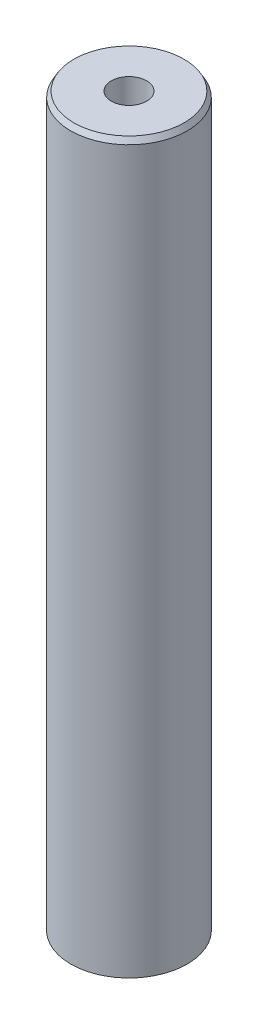
ISO-10303-21;
HEADER;
FILE_DESCRIPTION(('STEP AP214'),'2;1');
FILE_NAME('part.step','',(''),(''),'','','');
FILE_SCHEMA(('AUTOMOTIVE_DESIGN { 1 0 10303 214 1 1 1 1 }'));
ENDSEC;
DATA;
#1=APPLICATION_CONTEXT('core data for automotive mechanical design processes');
#2=APPLICATION_PROTOCOL_DEFINITION('international standard','automotive_design',2000,#1);
#3=PRODUCT_CONTEXT('',#1,'mechanical');
#4=PRODUCT('Part','Part','',(#3));
#5=PRODUCT_RELATED_PRODUCT_CATEGORY('part','',(#4));
#6=PRODUCT_DEFINITION_FORMATION('','',#4);
#7=PRODUCT_DEFINITION_CONTEXT('part definition',#1,'design');
#8=PRODUCT_DEFINITION('design','',#6,#7);
#9=PRODUCT_DEFINITION_SHAPE('','',#8);
#10=(LENGTH_UNIT() NAMED_UNIT(*) SI_UNIT(.MILLI.,.METRE.));
#11=(NAMED_UNIT(*) PLANE_ANGLE_UNIT() SI_UNIT($,.RADIAN.));
#12=(NAMED_UNIT(*) SI_UNIT($,.STERADIAN.) SOLID_ANGLE_UNIT());
#13=UNCERTAINTY_MEASURE_WITH_UNIT(LENGTH_MEASURE(1.E-05),#10,'distance_accuracy_value','');
#14=(GEOMETRIC_REPRESENTATION_CONTEXT(3) GLOBAL_UNCERTAINTY_ASSIGNED_CONTEXT((#13)) GLOBAL_UNIT_ASSIGNED_CONTEXT((#10,
#11,#12)) REPRESENTATION_CONTEXT('',''));
#15=CARTESIAN_POINT('',(0.,0.,0.));
#16=DIRECTION('',(0.,0.,1.));
#17=DIRECTION('',(1.,0.,0.));
#18=AXIS2_PLACEMENT_3D('',#15,#16,#17);
#19=CARTESIAN_POINT('',(0.,438.741525069619,0.));
#20=DIRECTION('',(0.,-1.,0.));
#21=DIRECTION('',(0.,0.,-1.));
#22=AXIS2_PLACEMENT_3D('',#19,#20,#21);
#23=CYLINDRICAL_SURFACE('',#22,35.);
#24=CARTESIAN_POINT('',(0.,435.481945707444,0.));
#25=DIRECTION('',(0.,1.,0.));
#26=DIRECTION('',(0.,0.,1.));
#27=AXIS2_PLACEMENT_3D('',#24,#25,#26);
#28=CIRCLE('',#27,35.);
#29=CARTESIAN_POINT('',(0.,435.481945707444,35.));
#30=VERTEX_POINT('',#29);
#31=EDGE_CURVE('E50',#30,#30,#28,.F.);
#32=ORIENTED_EDGE('',*,*,#31,.T.);
#33=EDGE_LOOP('',(#32));
#34=FACE_BOUND('',#33,.T.);
#35=CARTESIAN_POINT('',(0.,1.88191902219703,0.));
#36=DIRECTION('',(0.,1.,0.));
#37=DIRECTION('',(0.,0.,1.));
#38=AXIS2_PLACEMENT_3D('',#35,#36,#37);
#39=CIRCLE('',#38,35.);
#40=CARTESIAN_POINT('',(0.,1.88191902219703,35.));
#41=VERTEX_POINT('',#40);
#42=EDGE_CURVE('E51',#41,#41,#39,.T.);
#43=ORIENTED_EDGE('',*,*,#42,.T.);
#44=EDGE_LOOP('',(#43));
#45=FACE_BOUND('',#44,.T.);
#46=ADVANCED_FACE('F39',(#34,#45),#23,.T.);
#47=CARTESIAN_POINT('',(0.,438.741525069619,0.));
#48=DIRECTION('',(0.,1.,0.));
#49=DIRECTION('',(0.,0.,1.));
#50=AXIS2_PLACEMENT_3D('',#47,#48,#49);
#51=PLANE('',#50);
#52=CARTESIAN_POINT('',(0.,438.741525069619,0.));
#53=DIRECTION('',(0.,1.,0.));
#54=DIRECTION('',(0.,0.,1.));
#55=AXIS2_PLACEMENT_3D('',#52,#53,#54);
#56=CIRCLE('',#55,33.1180809778031);
#57=CARTESIAN_POINT('',(0.,438.741525069619,33.1180809778031));
#58=VERTEX_POINT('',#57);
#59=EDGE_CURVE('E54',#58,#58,#56,.T.);
#60=ORIENTED_EDGE('',*,*,#59,.T.);
#61=EDGE_LOOP('',(#60));
#62=FACE_BOUND('',#61,.T.);
#63=CARTESIAN_POINT('',(0.,438.741525069619,0.));
#64=DIRECTION('',(0.,1.,0.));
#65=DIRECTION('',(0.,0.,1.));
#66=AXIS2_PLACEMENT_3D('',#63,#64,#65);
#67=CIRCLE('',#66,10.6327622677194);
#68=CARTESIAN_POINT('',(0.,438.741525069619,10.6327622677194));
#69=VERTEX_POINT('',#68);
#70=EDGE_CURVE('E58',#69,#69,#67,.T.);
#71=ORIENTED_EDGE('',*,*,#70,.F.);
#72=EDGE_LOOP('',(#71));
#73=FACE_BOUND('',#72,.T.);
#74=ADVANCED_FACE('F69',(#62,#73),#51,.T.);
#75=CARTESIAN_POINT('',(0.,0.,0.));
#76=DIRECTION('',(0.,1.,0.));
#77=DIRECTION('',(0.,0.,1.));
#78=AXIS2_PLACEMENT_3D('',#75,#76,#77);
#79=PLANE('',#78);
#80=CARTESIAN_POINT('',(0.,0.,0.));
#81=DIRECTION('',(0.,1.,0.));
#82=DIRECTION('',(0.,0.,1.));
#83=AXIS2_PLACEMENT_3D('',#80,#81,#82);
#84=CIRCLE('',#83,31.7404206378244);
#85=CARTESIAN_POINT('',(0.,0.,31.7404206378244));
#86=VERTEX_POINT('',#85);
#87=EDGE_CURVE('E10',#86,#86,#84,.F.);
#88=ORIENTED_EDGE('',*,*,#87,.T.);
#89=EDGE_LOOP('',(#88));
#90=FACE_BOUND('',#89,.T.);
#91=CARTESIAN_POINT('',(0.,0.,0.));
#92=DIRECTION('',(0.,1.,0.));
#93=DIRECTION('',(0.,0.,1.));
#94=AXIS2_PLACEMENT_3D('',#91,#92,#93);
#95=CIRCLE('',#94,10.6327622677194);
#96=CARTESIAN_POINT('',(0.,0.,10.6327622677194));
#97=VERTEX_POINT('',#96);
#98=EDGE_CURVE('E63',#97,#97,#95,.T.);
#99=ORIENTED_EDGE('',*,*,#98,.T.);
#100=EDGE_LOOP('',(#99));
#101=FACE_BOUND('',#100,.T.);
#102=ADVANCED_FACE('F75',(#90,#101),#79,.F.);
#103=CARTESIAN_POINT('',(0.,438.741525069619,0.));
#104=DIRECTION('',(0.,-1.,0.));
#105=DIRECTION('',(0.,0.,-1.));
#106=AXIS2_PLACEMENT_3D('',#103,#104,#105);
#107=CYLINDRICAL_SURFACE('',#106,10.6327622677194);
#108=ORIENTED_EDGE('',*,*,#70,.T.);
#109=EDGE_LOOP('',(#108));
#110=FACE_BOUND('',#109,.T.);
#111=ORIENTED_EDGE('',*,*,#98,.F.);
#112=EDGE_LOOP('',(#111));
#113=FACE_BOUND('',#112,.T.);
#114=ADVANCED_FACE('F70',(#110,#113),#107,.F.);
#115=CARTESIAN_POINT('',(0.,438.741525069619,0.));
#116=DIRECTION('',(0.,-1.,0.));
#117=DIRECTION('',(0.,0.,-1.));
#118=AXIS2_PLACEMENT_3D('',#115,#116,#117);
#119=CONICAL_SURFACE('',#118,33.1180809778031,0.523598775598292);
#120=ORIENTED_EDGE('',*,*,#31,.F.);
#121=EDGE_LOOP('',(#120));
#122=FACE_BOUND('',#121,.T.);
#123=ORIENTED_EDGE('',*,*,#59,.F.);
#124=EDGE_LOOP('',(#123));
#125=FACE_BOUND('',#124,.T.);
#126=ADVANCED_FACE('F81',(#122,#125),#119,.T.);
#127=CARTESIAN_POINT('',(0.,1.88191902219703,0.));
#128=DIRECTION('',(0.,1.,0.));
#129=DIRECTION('',(0.,0.,1.));
#130=AXIS2_PLACEMENT_3D('',#127,#128,#129);
#131=CONICAL_SURFACE('',#130,35.,1.0471975511966);
#132=ORIENTED_EDGE('',*,*,#87,.F.);
#133=EDGE_LOOP('',(#132));
#134=FACE_BOUND('',#133,.T.);
#135=ORIENTED_EDGE('',*,*,#42,.F.);
#136=EDGE_LOOP('',(#135));
#137=FACE_BOUND('',#136,.T.);
#138=ADVANCED_FACE('F45',(#134,#137),#131,.T.);
#139=CLOSED_SHELL('',(#46,#74,#102,#114,#126,#138));
#140=MANIFOLD_SOLID_BREP('B2',#139);
#141=ADVANCED_BREP_SHAPE_REPRESENTATION('',(#18,#140),#14);
#142=SHAPE_DEFINITION_REPRESENTATION(#9,#141);
ENDSEC;
END-ISO-10303-21;
